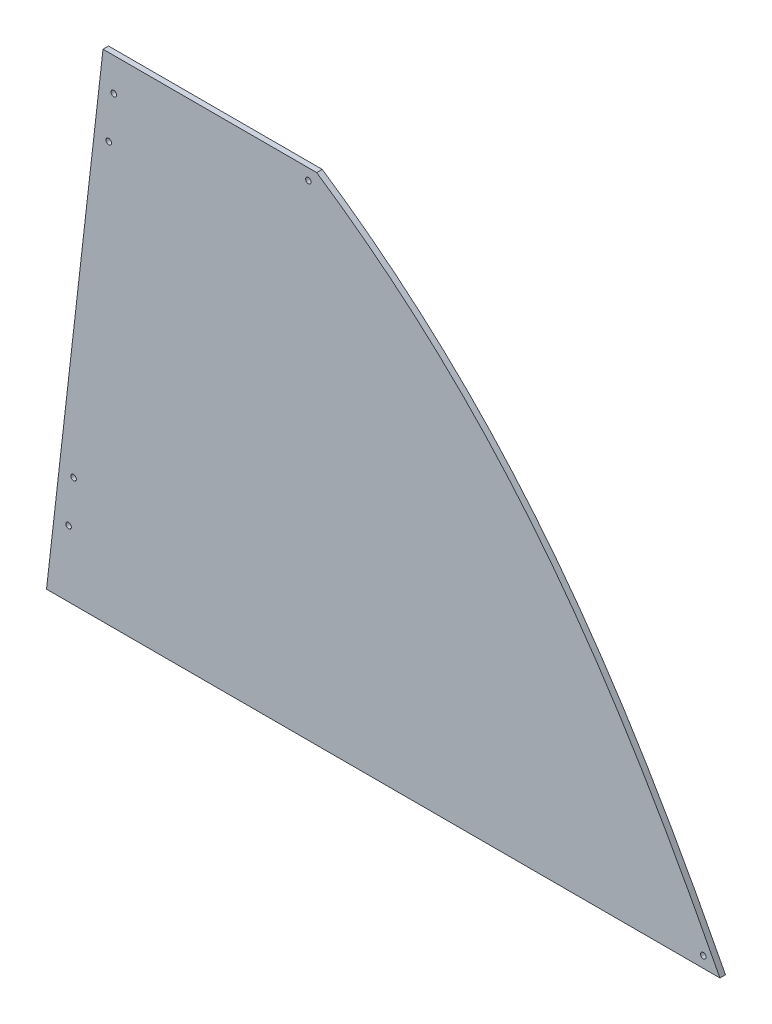
ISO-10303-21;
HEADER;
FILE_DESCRIPTION(('STEP AP214'),'2;1');
FILE_NAME('part.step','',(''),(''),'','','');
FILE_SCHEMA(('AUTOMOTIVE_DESIGN { 1 0 10303 214 1 1 1 1 }'));
ENDSEC;
DATA;
#1=APPLICATION_CONTEXT('core data for automotive mechanical design processes');
#2=APPLICATION_PROTOCOL_DEFINITION('international standard','automotive_design',2000,#1);
#3=PRODUCT_CONTEXT('',#1,'mechanical');
#4=PRODUCT('Part','Part','',(#3));
#5=PRODUCT_RELATED_PRODUCT_CATEGORY('part','',(#4));
#6=PRODUCT_DEFINITION_FORMATION('','',#4);
#7=PRODUCT_DEFINITION_CONTEXT('part definition',#1,'design');
#8=PRODUCT_DEFINITION('design','',#6,#7);
#9=PRODUCT_DEFINITION_SHAPE('','',#8);
#10=(LENGTH_UNIT() NAMED_UNIT(*) SI_UNIT(.MILLI.,.METRE.));
#11=(NAMED_UNIT(*) PLANE_ANGLE_UNIT() SI_UNIT($,.RADIAN.));
#12=(NAMED_UNIT(*) SI_UNIT($,.STERADIAN.) SOLID_ANGLE_UNIT());
#13=UNCERTAINTY_MEASURE_WITH_UNIT(LENGTH_MEASURE(1.E-05),#10,'distance_accuracy_value','');
#14=(GEOMETRIC_REPRESENTATION_CONTEXT(3) GLOBAL_UNCERTAINTY_ASSIGNED_CONTEXT((#13)) GLOBAL_UNIT_ASSIGNED_CONTEXT((#10,
#11,#12)) REPRESENTATION_CONTEXT('',''));
#15=CARTESIAN_POINT('',(0.,0.,0.));
#16=DIRECTION('',(0.,0.,1.));
#17=DIRECTION('',(1.,0.,0.));
#18=AXIS2_PLACEMENT_3D('',#15,#16,#17);
#19=CARTESIAN_POINT('',(546.176583356864,314.686016228379,0.));
#20=DIRECTION('',(0.,0.,1.));
#21=DIRECTION('',(1.,0.,0.));
#22=AXIS2_PLACEMENT_3D('',#19,#20,#21);
#23=PLANE('',#22);
#24=CARTESIAN_POINT('',(720.09,12.7,0.));
#25=DIRECTION('',(0.,0.,1.));
#26=DIRECTION('',(1.,0.,0.));
#27=AXIS2_PLACEMENT_3D('',#24,#25,#26);
#28=CIRCLE('',#27,3.17500000000004);
#29=CARTESIAN_POINT('',(723.265,12.7,0.));
#30=VERTEX_POINT('',#29);
#31=EDGE_CURVE('E172',#30,#30,#28,.T.);
#32=ORIENTED_EDGE('',*,*,#31,.T.);
#33=EDGE_LOOP('',(#32));
#34=FACE_BOUND('',#33,.T.);
#35=CARTESIAN_POINT('',(267.895636668357,555.12631551917,0.));
#36=DIRECTION('',(0.,0.,1.));
#37=DIRECTION('',(1.,0.,0.));
#38=AXIS2_PLACEMENT_3D('',#35,#36,#37);
#39=CIRCLE('',#38,3.17499999999998);
#40=CARTESIAN_POINT('',(271.070636668357,555.12631551917,0.));
#41=VERTEX_POINT('',#40);
#42=EDGE_CURVE('E185',#41,#41,#39,.T.);
#43=ORIENTED_EDGE('',*,*,#42,.T.);
#44=EDGE_LOOP('',(#43));
#45=FACE_BOUND('',#44,.T.);
#46=CARTESIAN_POINT('',(-6.71251383721748,75.710175402556,0.));
#47=DIRECTION('',(0.,0.,1.));
#48=DIRECTION('',(1.,0.,0.));
#49=AXIS2_PLACEMENT_3D('',#46,#47,#48);
#50=CIRCLE('',#49,3.17499999999999);
#51=CARTESIAN_POINT('',(-3.53751383721748,75.710175402556,0.));
#52=VERTEX_POINT('',#51);
#53=EDGE_CURVE('E190',#52,#52,#50,.F.);
#54=ORIENTED_EDGE('',*,*,#53,.F.);
#55=EDGE_LOOP('',(#54));
#56=FACE_BOUND('',#55,.T.);
#57=CARTESIAN_POINT('',(-0.961790577808013,126.183625670927,0.));
#58=DIRECTION('',(0.,0.,1.));
#59=DIRECTION('',(1.,0.,0.));
#60=AXIS2_PLACEMENT_3D('',#57,#58,#59);
#61=CIRCLE('',#60,3.17499999999999);
#62=CARTESIAN_POINT('',(2.21320942219198,126.183625670927,0.));
#63=VERTEX_POINT('',#62);
#64=EDGE_CURVE('E198',#63,#63,#61,.F.);
#65=ORIENTED_EDGE('',*,*,#64,.F.);
#66=EDGE_LOOP('',(#65));
#67=FACE_BOUND('',#66,.T.);
#68=CARTESIAN_POINT('',(39.2932722380583,479.497777549522,0.));
#69=DIRECTION('',(0.,0.,1.));
#70=DIRECTION('',(1.,0.,0.));
#71=AXIS2_PLACEMENT_3D('',#68,#69,#70);
#72=CIRCLE('',#71,3.17499999999999);
#73=CARTESIAN_POINT('',(42.4682722380583,479.497777549522,0.));
#74=VERTEX_POINT('',#73);
#75=EDGE_CURVE('E206',#74,#74,#72,.F.);
#76=ORIENTED_EDGE('',*,*,#75,.F.);
#77=EDGE_LOOP('',(#76));
#78=FACE_BOUND('',#77,.T.);
#79=DIRECTION('',(1.,0.,0.));
#80=VECTOR('',#79,1.);
#81=CARTESIAN_POINT('',(0.,0.,0.));
#82=LINE('',#81,#80);
#83=CARTESIAN_POINT('',(-31.9554140131912,0.,0.));
#84=VERTEX_POINT('',#83);
#85=CARTESIAN_POINT('',(739.14,0.,0.));
#86=VERTEX_POINT('',#85);
#87=EDGE_CURVE('E71',#84,#86,#82,.T.);
#88=ORIENTED_EDGE('',*,*,#87,.F.);
#89=DIRECTION('',(0.113203213767903,0.993571855676588,0.));
#90=VECTOR('',#89,1.);
#91=CARTESIAN_POINT('',(32.7402226551654,567.82631551917,0.));
#92=LINE('',#91,#90);
#93=CARTESIAN_POINT('',(32.7402226551654,567.82631551917,0.));
#94=VERTEX_POINT('',#93);
#95=EDGE_CURVE('E111',#84,#94,#92,.T.);
#96=ORIENTED_EDGE('',*,*,#95,.T.);
#97=DIRECTION('',(-1.,0.,0.));
#98=VECTOR('',#97,1.);
#99=CARTESIAN_POINT('',(64.6956366683566,567.82631551917,0.));
#100=LINE('',#99,#98);
#101=CARTESIAN_POINT('',(277.420636668357,567.82631551917,0.));
#102=VERTEX_POINT('',#101);
#103=EDGE_CURVE('E82',#102,#94,#100,.T.);
#104=ORIENTED_EDGE('',*,*,#103,.F.);
#105=CARTESIAN_POINT('',(739.14,0.,0.));
#106=CARTESIAN_POINT('',(620.758181584613,229.590161118797,0.));
#107=CARTESIAN_POINT('',(496.859161810905,420.297110317156,0.));
#108=CARTESIAN_POINT('',(277.420636668357,567.82631551917,0.));
#109=B_SPLINE_CURVE_WITH_KNOTS('',3,(#105,#106,#107,#108),.UNSPECIFIED.,.F.,.F.,(4,4),(0.,1.),.UNSPECIFIED.);
#110=EDGE_CURVE('E243',#86,#102,#109,.T.);
#111=ORIENTED_EDGE('',*,*,#110,.F.);
#112=EDGE_LOOP('',(#88,#96,#104,#111));
#113=FACE_BOUND('',#112,.T.);
#114=CARTESIAN_POINT('',(45.0439954974677,529.971227817892,0.));
#115=DIRECTION('',(0.,0.,1.));
#116=DIRECTION('',(1.,0.,0.));
#117=AXIS2_PLACEMENT_3D('',#114,#115,#116);
#118=CIRCLE('',#117,3.17499999999999);
#119=CARTESIAN_POINT('',(48.2189954974677,529.971227817892,0.));
#120=VERTEX_POINT('',#119);
#121=EDGE_CURVE('E116',#120,#120,#118,.F.);
#122=ORIENTED_EDGE('',*,*,#121,.F.);
#123=EDGE_LOOP('',(#122));
#124=FACE_BOUND('',#123,.T.);
#125=ADVANCED_FACE('F34',(#34,#45,#56,#67,#78,#113,#124),#23,.F.);
#126=CARTESIAN_POINT('',(0.,0.,6.35));
#127=DIRECTION('',(0.,1.,0.));
#128=DIRECTION('',(0.,0.,1.));
#129=AXIS2_PLACEMENT_3D('',#126,#127,#128);
#130=PLANE('',#129);
#131=ORIENTED_EDGE('',*,*,#87,.T.);
#132=DIRECTION('',(0.,0.,-1.));
#133=VECTOR('',#132,1.);
#134=CARTESIAN_POINT('',(739.14,0.,6.35));
#135=LINE('',#134,#133);
#136=CARTESIAN_POINT('',(739.14,0.,6.35));
#137=VERTEX_POINT('',#136);
#138=EDGE_CURVE('E11',#137,#86,#135,.T.);
#139=ORIENTED_EDGE('',*,*,#138,.F.);
#140=DIRECTION('',(1.,0.,0.));
#141=VECTOR('',#140,1.);
#142=CARTESIAN_POINT('',(0.,0.,6.35));
#143=LINE('',#142,#141);
#144=CARTESIAN_POINT('',(-31.9554140131912,0.,6.34999999999997));
#145=VERTEX_POINT('',#144);
#146=EDGE_CURVE('E96',#145,#137,#143,.T.);
#147=ORIENTED_EDGE('',*,*,#146,.F.);
#148=DIRECTION('',(0.,0.,-1.));
#149=VECTOR('',#148,1.);
#150=CARTESIAN_POINT('',(-31.9554140131912,0.,582.343185891919));
#151=LINE('',#150,#149);
#152=EDGE_CURVE('E98',#145,#84,#151,.T.);
#153=ORIENTED_EDGE('',*,*,#152,.T.);
#154=EDGE_LOOP('',(#131,#139,#147,#153));
#155=FACE_BOUND('',#154,.T.);
#156=ADVANCED_FACE('F36',(#155),#130,.F.);
#157=CARTESIAN_POINT('',(739.14,0.,6.35));
#158=CARTESIAN_POINT('',(620.758181584613,229.590161118797,6.35));
#159=CARTESIAN_POINT('',(496.859161810905,420.297110317156,6.35));
#160=CARTESIAN_POINT('',(277.420636668357,567.82631551917,6.35));
#161=B_SPLINE_CURVE_WITH_KNOTS('',3,(#157,#158,#159,#160),.UNSPECIFIED.,.F.,.F.,(4,4),(0.,1.),.UNSPECIFIED.);
#162=DIRECTION('',(0.,0.,-1.));
#163=VECTOR('',#162,1.);
#164=SURFACE_OF_LINEAR_EXTRUSION('',#161,#163);
#165=ORIENTED_EDGE('',*,*,#110,.T.);
#166=DIRECTION('',(0.,0.,-1.));
#167=VECTOR('',#166,1.);
#168=CARTESIAN_POINT('',(277.420636668357,567.82631551917,6.35));
#169=LINE('',#168,#167);
#170=CARTESIAN_POINT('',(277.420636668357,567.82631551917,6.35));
#171=VERTEX_POINT('',#170);
#172=EDGE_CURVE('E44',#171,#102,#169,.T.);
#173=ORIENTED_EDGE('',*,*,#172,.F.);
#174=EDGE_CURVE('E56',#137,#171,#161,.T.);
#175=ORIENTED_EDGE('',*,*,#174,.F.);
#176=ORIENTED_EDGE('',*,*,#138,.T.);
#177=EDGE_LOOP('',(#165,#173,#175,#176));
#178=FACE_BOUND('',#177,.T.);
#179=ADVANCED_FACE('F129',(#178),#164,.F.);
#180=CARTESIAN_POINT('',(64.6956366683566,567.82631551917,6.35));
#181=DIRECTION('',(0.,-1.,0.));
#182=DIRECTION('',(1.,0.,0.));
#183=AXIS2_PLACEMENT_3D('',#180,#181,#182);
#184=PLANE('',#183);
#185=ORIENTED_EDGE('',*,*,#103,.T.);
#186=DIRECTION('',(0.,0.,-1.));
#187=VECTOR('',#186,1.);
#188=CARTESIAN_POINT('',(32.7402226551654,567.82631551917,582.343185891919));
#189=LINE('',#188,#187);
#190=CARTESIAN_POINT('',(32.7402226551654,567.82631551917,6.34999999999997));
#191=VERTEX_POINT('',#190);
#192=EDGE_CURVE('E107',#191,#94,#189,.T.);
#193=ORIENTED_EDGE('',*,*,#192,.F.);
#194=DIRECTION('',(-1.,0.,0.));
#195=VECTOR('',#194,1.);
#196=CARTESIAN_POINT('',(64.6956366683566,567.82631551917,6.35));
#197=LINE('',#196,#195);
#198=EDGE_CURVE('E93',#171,#191,#197,.T.);
#199=ORIENTED_EDGE('',*,*,#198,.F.);
#200=ORIENTED_EDGE('',*,*,#172,.T.);
#201=EDGE_LOOP('',(#185,#193,#199,#200));
#202=FACE_BOUND('',#201,.T.);
#203=ADVANCED_FACE('F132',(#202),#184,.F.);
#204=CARTESIAN_POINT('',(546.176583356864,314.686016228379,6.35));
#205=DIRECTION('',(0.,0.,1.));
#206=DIRECTION('',(1.,0.,0.));
#207=AXIS2_PLACEMENT_3D('',#204,#205,#206);
#208=PLANE('',#207);
#209=CARTESIAN_POINT('',(720.09,12.7,6.35));
#210=DIRECTION('',(0.,0.,1.));
#211=DIRECTION('',(1.,0.,0.));
#212=AXIS2_PLACEMENT_3D('',#209,#210,#211);
#213=CIRCLE('',#212,3.17500000000004);
#214=CARTESIAN_POINT('',(723.265,12.7,6.35));
#215=VERTEX_POINT('',#214);
#216=EDGE_CURVE('E175',#215,#215,#213,.T.);
#217=ORIENTED_EDGE('',*,*,#216,.F.);
#218=EDGE_LOOP('',(#217));
#219=FACE_BOUND('',#218,.T.);
#220=CARTESIAN_POINT('',(267.895636668357,555.12631551917,6.35));
#221=DIRECTION('',(0.,0.,1.));
#222=DIRECTION('',(1.,0.,0.));
#223=AXIS2_PLACEMENT_3D('',#220,#221,#222);
#224=CIRCLE('',#223,3.17499999999998);
#225=CARTESIAN_POINT('',(271.070636668357,555.12631551917,6.35));
#226=VERTEX_POINT('',#225);
#227=EDGE_CURVE('E179',#226,#226,#224,.T.);
#228=ORIENTED_EDGE('',*,*,#227,.F.);
#229=EDGE_LOOP('',(#228));
#230=FACE_BOUND('',#229,.T.);
#231=CARTESIAN_POINT('',(-6.71251383721748,75.710175402556,6.35));
#232=DIRECTION('',(0.,0.,1.));
#233=DIRECTION('',(1.,0.,0.));
#234=AXIS2_PLACEMENT_3D('',#231,#232,#233);
#235=CIRCLE('',#234,3.17499999999999);
#236=CARTESIAN_POINT('',(-3.53751383721749,75.710175402556,6.35));
#237=VERTEX_POINT('',#236);
#238=EDGE_CURVE('E189',#237,#237,#235,.T.);
#239=ORIENTED_EDGE('',*,*,#238,.F.);
#240=EDGE_LOOP('',(#239));
#241=FACE_BOUND('',#240,.T.);
#242=CARTESIAN_POINT('',(-0.961790577808013,126.183625670927,6.35));
#243=DIRECTION('',(0.,0.,1.));
#244=DIRECTION('',(1.,0.,0.));
#245=AXIS2_PLACEMENT_3D('',#242,#243,#244);
#246=CIRCLE('',#245,3.17499999999999);
#247=CARTESIAN_POINT('',(2.21320942219198,126.183625670927,6.35));
#248=VERTEX_POINT('',#247);
#249=EDGE_CURVE('E194',#248,#248,#246,.T.);
#250=ORIENTED_EDGE('',*,*,#249,.F.);
#251=EDGE_LOOP('',(#250));
#252=FACE_BOUND('',#251,.T.);
#253=CARTESIAN_POINT('',(39.2932722380583,479.497777549522,6.35));
#254=DIRECTION('',(0.,0.,1.));
#255=DIRECTION('',(1.,0.,0.));
#256=AXIS2_PLACEMENT_3D('',#253,#254,#255);
#257=CIRCLE('',#256,3.17499999999999);
#258=CARTESIAN_POINT('',(42.4682722380583,479.497777549522,6.35));
#259=VERTEX_POINT('',#258);
#260=EDGE_CURVE('E202',#259,#259,#257,.T.);
#261=ORIENTED_EDGE('',*,*,#260,.F.);
#262=EDGE_LOOP('',(#261));
#263=FACE_BOUND('',#262,.T.);
#264=CARTESIAN_POINT('',(45.0439954974677,529.971227817892,6.35));
#265=DIRECTION('',(0.,0.,1.));
#266=DIRECTION('',(1.,0.,0.));
#267=AXIS2_PLACEMENT_3D('',#264,#265,#266);
#268=CIRCLE('',#267,3.17499999999999);
#269=CARTESIAN_POINT('',(48.2189954974677,529.971227817892,6.35));
#270=VERTEX_POINT('',#269);
#271=EDGE_CURVE('E210',#270,#270,#268,.T.);
#272=ORIENTED_EDGE('',*,*,#271,.F.);
#273=EDGE_LOOP('',(#272));
#274=FACE_BOUND('',#273,.T.);
#275=ORIENTED_EDGE('',*,*,#198,.T.);
#276=DIRECTION('',(0.113203213767903,0.993571855676588,0.));
#277=VECTOR('',#276,1.);
#278=CARTESIAN_POINT('',(32.7402226551654,567.82631551917,6.34999999999997));
#279=LINE('',#278,#277);
#280=EDGE_CURVE('E103',#145,#191,#279,.T.);
#281=ORIENTED_EDGE('',*,*,#280,.F.);
#282=ORIENTED_EDGE('',*,*,#146,.T.);
#283=ORIENTED_EDGE('',*,*,#174,.T.);
#284=EDGE_LOOP('',(#275,#281,#282,#283));
#285=FACE_BOUND('',#284,.T.);
#286=ADVANCED_FACE('F104',(#219,#230,#241,#252,#263,#274,#285),#208,.T.);
#287=CARTESIAN_POINT('',(32.7402226551654,567.82631551917,582.343185891919));
#288=DIRECTION('',(-0.993571855676588,0.113203213767903,0.));
#289=DIRECTION('',(-0.113203213767903,-0.993571855676588,0.));
#290=AXIS2_PLACEMENT_3D('',#287,#288,#289);
#291=PLANE('',#290);
#292=ORIENTED_EDGE('',*,*,#152,.F.);
#293=ORIENTED_EDGE('',*,*,#280,.T.);
#294=ORIENTED_EDGE('',*,*,#192,.T.);
#295=ORIENTED_EDGE('',*,*,#95,.F.);
#296=EDGE_LOOP('',(#292,#293,#294,#295));
#297=FACE_BOUND('',#296,.T.);
#298=ADVANCED_FACE('F109',(#297),#291,.T.);
#299=CARTESIAN_POINT('',(45.0439954974677,529.971227817892,6.35));
#300=DIRECTION('',(0.,0.,1.));
#301=DIRECTION('',(1.,0.,0.));
#302=AXIS2_PLACEMENT_3D('',#299,#300,#301);
#303=CYLINDRICAL_SURFACE('',#302,3.17499999999999);
#304=ORIENTED_EDGE('',*,*,#121,.T.);
#305=EDGE_LOOP('',(#304));
#306=FACE_BOUND('',#305,.T.);
#307=ORIENTED_EDGE('',*,*,#271,.T.);
#308=EDGE_LOOP('',(#307));
#309=FACE_BOUND('',#308,.T.);
#310=ADVANCED_FACE('F144',(#306,#309),#303,.F.);
#311=CARTESIAN_POINT('',(39.2932722380583,479.497777549522,6.35));
#312=DIRECTION('',(0.,0.,1.));
#313=DIRECTION('',(1.,0.,0.));
#314=AXIS2_PLACEMENT_3D('',#311,#312,#313);
#315=CYLINDRICAL_SURFACE('',#314,3.17499999999999);
#316=ORIENTED_EDGE('',*,*,#75,.T.);
#317=EDGE_LOOP('',(#316));
#318=FACE_BOUND('',#317,.T.);
#319=ORIENTED_EDGE('',*,*,#260,.T.);
#320=EDGE_LOOP('',(#319));
#321=FACE_BOUND('',#320,.T.);
#322=ADVANCED_FACE('F147',(#318,#321),#315,.F.);
#323=CARTESIAN_POINT('',(-0.961790577808013,126.183625670927,6.35));
#324=DIRECTION('',(0.,0.,1.));
#325=DIRECTION('',(1.,0.,0.));
#326=AXIS2_PLACEMENT_3D('',#323,#324,#325);
#327=CYLINDRICAL_SURFACE('',#326,3.17499999999999);
#328=ORIENTED_EDGE('',*,*,#64,.T.);
#329=EDGE_LOOP('',(#328));
#330=FACE_BOUND('',#329,.T.);
#331=ORIENTED_EDGE('',*,*,#249,.T.);
#332=EDGE_LOOP('',(#331));
#333=FACE_BOUND('',#332,.T.);
#334=ADVANCED_FACE('F151',(#330,#333),#327,.F.);
#335=CARTESIAN_POINT('',(-6.71251383721748,75.710175402556,6.35));
#336=DIRECTION('',(0.,0.,1.));
#337=DIRECTION('',(1.,0.,0.));
#338=AXIS2_PLACEMENT_3D('',#335,#336,#337);
#339=CYLINDRICAL_SURFACE('',#338,3.17499999999999);
#340=ORIENTED_EDGE('',*,*,#53,.T.);
#341=EDGE_LOOP('',(#340));
#342=FACE_BOUND('',#341,.T.);
#343=ORIENTED_EDGE('',*,*,#238,.T.);
#344=EDGE_LOOP('',(#343));
#345=FACE_BOUND('',#344,.T.);
#346=ADVANCED_FACE('F155',(#342,#345),#339,.F.);
#347=CARTESIAN_POINT('',(267.895636668357,555.12631551917,6.35));
#348=DIRECTION('',(0.,0.,1.));
#349=DIRECTION('',(1.,0.,0.));
#350=AXIS2_PLACEMENT_3D('',#347,#348,#349);
#351=CYLINDRICAL_SURFACE('',#350,3.17499999999998);
#352=ORIENTED_EDGE('',*,*,#42,.F.);
#353=EDGE_LOOP('',(#352));
#354=FACE_BOUND('',#353,.T.);
#355=ORIENTED_EDGE('',*,*,#227,.T.);
#356=EDGE_LOOP('',(#355));
#357=FACE_BOUND('',#356,.T.);
#358=ADVANCED_FACE('F159',(#354,#357),#351,.F.);
#359=CARTESIAN_POINT('',(720.09,12.7,6.35));
#360=DIRECTION('',(0.,0.,1.));
#361=DIRECTION('',(1.,0.,0.));
#362=AXIS2_PLACEMENT_3D('',#359,#360,#361);
#363=CYLINDRICAL_SURFACE('',#362,3.17500000000004);
#364=ORIENTED_EDGE('',*,*,#31,.F.);
#365=EDGE_LOOP('',(#364));
#366=FACE_BOUND('',#365,.T.);
#367=ORIENTED_EDGE('',*,*,#216,.T.);
#368=EDGE_LOOP('',(#367));
#369=FACE_BOUND('',#368,.T.);
#370=ADVANCED_FACE('F163',(#366,#369),#363,.F.);
#371=CLOSED_SHELL('',(#125,#156,#179,#203,#286,#298,#310,#322,#334,#346,#358,#370));
#372=MANIFOLD_SOLID_BREP('B2',#371);
#373=ADVANCED_BREP_SHAPE_REPRESENTATION('',(#18,#372),#14);
#374=SHAPE_DEFINITION_REPRESENTATION(#9,#373);
ENDSEC;
END-ISO-10303-21;
